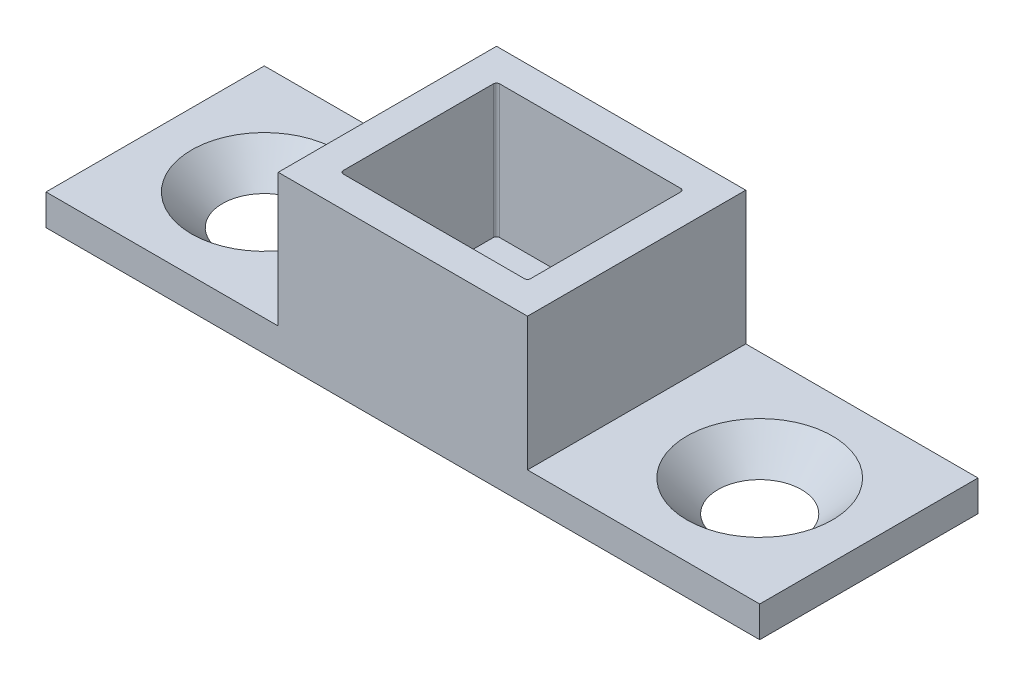
ISO-10303-21;
HEADER;
FILE_DESCRIPTION(('STEP AP214'),'2;1');
FILE_NAME('part.step','',(''),(''),'','','');
FILE_SCHEMA(('AUTOMOTIVE_DESIGN { 1 0 10303 214 1 1 1 1 }'));
ENDSEC;
DATA;
#1=APPLICATION_CONTEXT('core data for automotive mechanical design processes');
#2=APPLICATION_PROTOCOL_DEFINITION('international standard','automotive_design',2000,#1);
#3=PRODUCT_CONTEXT('',#1,'mechanical');
#4=PRODUCT('Part','Part','',(#3));
#5=PRODUCT_RELATED_PRODUCT_CATEGORY('part','',(#4));
#6=PRODUCT_DEFINITION_FORMATION('','',#4);
#7=PRODUCT_DEFINITION_CONTEXT('part definition',#1,'design');
#8=PRODUCT_DEFINITION('design','',#6,#7);
#9=PRODUCT_DEFINITION_SHAPE('','',#8);
#10=(LENGTH_UNIT() NAMED_UNIT(*) SI_UNIT(.MILLI.,.METRE.));
#11=(NAMED_UNIT(*) PLANE_ANGLE_UNIT() SI_UNIT($,.RADIAN.));
#12=(NAMED_UNIT(*) SI_UNIT($,.STERADIAN.) SOLID_ANGLE_UNIT());
#13=UNCERTAINTY_MEASURE_WITH_UNIT(LENGTH_MEASURE(1.E-05),#10,'distance_accuracy_value','');
#14=(GEOMETRIC_REPRESENTATION_CONTEXT(3) GLOBAL_UNCERTAINTY_ASSIGNED_CONTEXT((#13)) GLOBAL_UNIT_ASSIGNED_CONTEXT((#10,
#11,#12)) REPRESENTATION_CONTEXT('',''));
#15=CARTESIAN_POINT('',(0.,0.,0.));
#16=DIRECTION('',(0.,0.,1.));
#17=DIRECTION('',(1.,0.,0.));
#18=AXIS2_PLACEMENT_3D('',#15,#16,#17);
#19=CARTESIAN_POINT('',(-8.05,10.6,-7.05));
#20=DIRECTION('',(1.,0.,0.));
#21=DIRECTION('',(0.,0.,-1.));
#22=AXIS2_PLACEMENT_3D('',#19,#20,#21);
#23=PLANE('',#22);
#24=DIRECTION('',(0.,0.,-1.));
#25=VECTOR('',#24,1.);
#26=CARTESIAN_POINT('',(-8.05,2.,-7.05));
#27=LINE('',#26,#25);
#28=CARTESIAN_POINT('',(-8.05,2.,7.05));
#29=VERTEX_POINT('',#28);
#30=CARTESIAN_POINT('',(-8.05,2.,-7.05));
#31=VERTEX_POINT('',#30);
#32=EDGE_CURVE('E65',#29,#31,#27,.T.);
#33=ORIENTED_EDGE('',*,*,#32,.F.);
#34=DIRECTION('',(0.,-1.,0.));
#35=VECTOR('',#34,1.);
#36=CARTESIAN_POINT('',(-8.05,10.6,7.05));
#37=LINE('',#36,#35);
#38=CARTESIAN_POINT('',(-8.05,10.6,7.05));
#39=VERTEX_POINT('',#38);
#40=EDGE_CURVE('E176',#39,#29,#37,.T.);
#41=ORIENTED_EDGE('',*,*,#40,.F.);
#42=DIRECTION('',(0.,0.,1.));
#43=VECTOR('',#42,1.);
#44=CARTESIAN_POINT('',(-8.05,10.6,-7.05));
#45=LINE('',#44,#43);
#46=CARTESIAN_POINT('',(-8.05,10.6,-7.05));
#47=VERTEX_POINT('',#46);
#48=EDGE_CURVE('E257',#47,#39,#45,.T.);
#49=ORIENTED_EDGE('',*,*,#48,.F.);
#50=DIRECTION('',(0.,-1.,0.));
#51=VECTOR('',#50,1.);
#52=CARTESIAN_POINT('',(-8.05,10.6,-7.05));
#53=LINE('',#52,#51);
#54=EDGE_CURVE('E181',#47,#31,#53,.T.);
#55=ORIENTED_EDGE('',*,*,#54,.T.);
#56=EDGE_LOOP('',(#33,#41,#49,#55));
#57=FACE_BOUND('',#56,.T.);
#58=ADVANCED_FACE('F42',(#57),#23,.F.);
#59=CARTESIAN_POINT('',(0.,0.,0.));
#60=DIRECTION('',(0.,1.,0.));
#61=DIRECTION('',(0.,0.,1.));
#62=AXIS2_PLACEMENT_3D('',#59,#60,#61);
#63=PLANE('',#62);
#64=CARTESIAN_POINT('',(16.,0.,0.));
#65=DIRECTION('',(0.,1.,0.));
#66=DIRECTION('',(0.,0.,1.));
#67=AXIS2_PLACEMENT_3D('',#64,#65,#66);
#68=CIRCLE('',#67,2.7);
#69=CARTESIAN_POINT('',(16.,0.,2.7));
#70=VERTEX_POINT('',#69);
#71=EDGE_CURVE('E560',#70,#70,#68,.T.);
#72=ORIENTED_EDGE('',*,*,#71,.T.);
#73=EDGE_LOOP('',(#72));
#74=FACE_BOUND('',#73,.T.);
#75=CARTESIAN_POINT('',(-16.,0.,0.));
#76=DIRECTION('',(0.,1.,0.));
#77=DIRECTION('',(0.,0.,1.));
#78=AXIS2_PLACEMENT_3D('',#75,#76,#77);
#79=CIRCLE('',#78,2.7);
#80=CARTESIAN_POINT('',(-16.,0.,2.7));
#81=VERTEX_POINT('',#80);
#82=EDGE_CURVE('E286',#81,#81,#79,.T.);
#83=ORIENTED_EDGE('',*,*,#82,.T.);
#84=EDGE_LOOP('',(#83));
#85=FACE_BOUND('',#84,.T.);
#86=CARTESIAN_POINT('',(0.,0.,0.));
#87=DIRECTION('',(0.,1.,0.));
#88=DIRECTION('',(0.,0.,1.));
#89=AXIS2_PLACEMENT_3D('',#86,#87,#88);
#90=CIRCLE('',#89,2.25);
#91=CARTESIAN_POINT('',(0.,0.,2.25));
#92=VERTEX_POINT('',#91);
#93=EDGE_CURVE('E298',#92,#92,#90,.T.);
#94=ORIENTED_EDGE('',*,*,#93,.T.);
#95=EDGE_LOOP('',(#94));
#96=FACE_BOUND('',#95,.T.);
#97=CARTESIAN_POINT('',(4.5,0.,0.));
#98=DIRECTION('',(0.,-1.,0.));
#99=DIRECTION('',(0.,0.,-1.));
#100=AXIS2_PLACEMENT_3D('',#97,#98,#99);
#101=CIRCLE('',#100,2.);
#102=CARTESIAN_POINT('',(4.5,0.,-2.));
#103=VERTEX_POINT('',#102);
#104=EDGE_CURVE('E312',#103,#103,#101,.T.);
#105=ORIENTED_EDGE('',*,*,#104,.F.);
#106=EDGE_LOOP('',(#105));
#107=FACE_BOUND('',#106,.T.);
#108=DIRECTION('',(1.,0.,0.));
#109=VECTOR('',#108,1.);
#110=CARTESIAN_POINT('',(-8.05,0.,7.05));
#111=LINE('',#110,#109);
#112=CARTESIAN_POINT('',(-23.05,0.,7.05));
#113=VERTEX_POINT('',#112);
#114=CARTESIAN_POINT('',(23.05,0.,7.05));
#115=VERTEX_POINT('',#114);
#116=EDGE_CURVE('E247',#113,#115,#111,.T.);
#117=ORIENTED_EDGE('',*,*,#116,.F.);
#118=DIRECTION('',(0.,0.,1.));
#119=VECTOR('',#118,1.);
#120=CARTESIAN_POINT('',(-23.05,0.,-7.05));
#121=LINE('',#120,#119);
#122=CARTESIAN_POINT('',(-23.05,0.,-7.05));
#123=VERTEX_POINT('',#122);
#124=EDGE_CURVE('E283',#123,#113,#121,.T.);
#125=ORIENTED_EDGE('',*,*,#124,.F.);
#126=DIRECTION('',(-1.,0.,0.));
#127=VECTOR('',#126,1.);
#128=CARTESIAN_POINT('',(-8.05,0.,-7.05));
#129=LINE('',#128,#127);
#130=CARTESIAN_POINT('',(23.05,0.,-7.05));
#131=VERTEX_POINT('',#130);
#132=EDGE_CURVE('E249',#131,#123,#129,.T.);
#133=ORIENTED_EDGE('',*,*,#132,.F.);
#134=DIRECTION('',(0.,0.,1.));
#135=VECTOR('',#134,1.);
#136=CARTESIAN_POINT('',(23.05,0.,-7.05));
#137=LINE('',#136,#135);
#138=EDGE_CURVE('E163',#131,#115,#137,.T.);
#139=ORIENTED_EDGE('',*,*,#138,.T.);
#140=EDGE_LOOP('',(#117,#125,#133,#139));
#141=FACE_BOUND('',#140,.T.);
#142=CARTESIAN_POINT('',(-4.5,0.,0.));
#143=DIRECTION('',(0.,-1.,0.));
#144=DIRECTION('',(0.,0.,-1.));
#145=AXIS2_PLACEMENT_3D('',#142,#143,#144);
#146=CIRCLE('',#145,2.);
#147=CARTESIAN_POINT('',(-4.5,0.,-2.));
#148=VERTEX_POINT('',#147);
#149=EDGE_CURVE('E301',#148,#148,#146,.T.);
#150=ORIENTED_EDGE('',*,*,#149,.F.);
#151=EDGE_LOOP('',(#150));
#152=FACE_BOUND('',#151,.T.);
#153=ADVANCED_FACE('F355',(#74,#85,#96,#107,#141,#152),#63,.F.);
#154=CARTESIAN_POINT('',(-8.05,10.6,7.05));
#155=DIRECTION('',(0.,0.,-1.));
#156=DIRECTION('',(-1.,0.,0.));
#157=AXIS2_PLACEMENT_3D('',#154,#155,#156);
#158=PLANE('',#157);
#159=ORIENTED_EDGE('',*,*,#116,.T.);
#160=DIRECTION('',(0.,-1.,0.));
#161=VECTOR('',#160,1.);
#162=CARTESIAN_POINT('',(23.05,2.,7.05));
#163=LINE('',#162,#161);
#164=CARTESIAN_POINT('',(23.05,2.,7.05));
#165=VERTEX_POINT('',#164);
#166=EDGE_CURVE('E171',#165,#115,#163,.T.);
#167=ORIENTED_EDGE('',*,*,#166,.F.);
#168=DIRECTION('',(-1.,0.,0.));
#169=VECTOR('',#168,1.);
#170=CARTESIAN_POINT('',(8.05,2.,7.05));
#171=LINE('',#170,#169);
#172=CARTESIAN_POINT('',(8.05,2.,7.05));
#173=VERTEX_POINT('',#172);
#174=EDGE_CURVE('E157',#165,#173,#171,.T.);
#175=ORIENTED_EDGE('',*,*,#174,.T.);
#176=DIRECTION('',(0.,-1.,0.));
#177=VECTOR('',#176,1.);
#178=CARTESIAN_POINT('',(8.05,10.6,7.05));
#179=LINE('',#178,#177);
#180=CARTESIAN_POINT('',(8.05,10.6,7.05));
#181=VERTEX_POINT('',#180);
#182=EDGE_CURVE('E168',#181,#173,#179,.T.);
#183=ORIENTED_EDGE('',*,*,#182,.F.);
#184=DIRECTION('',(1.,0.,0.));
#185=VECTOR('',#184,1.);
#186=CARTESIAN_POINT('',(-8.05,10.6,7.05));
#187=LINE('',#186,#185);
#188=EDGE_CURVE('E260',#39,#181,#187,.T.);
#189=ORIENTED_EDGE('',*,*,#188,.F.);
#190=ORIENTED_EDGE('',*,*,#40,.T.);
#191=DIRECTION('',(1.,0.,0.));
#192=VECTOR('',#191,1.);
#193=CARTESIAN_POINT('',(-8.05,2.,7.05));
#194=LINE('',#193,#192);
#195=CARTESIAN_POINT('',(-23.05,2.,7.05));
#196=VERTEX_POINT('',#195);
#197=EDGE_CURVE('E282',#196,#29,#194,.T.);
#198=ORIENTED_EDGE('',*,*,#197,.F.);
#199=DIRECTION('',(0.,-1.,0.));
#200=VECTOR('',#199,1.);
#201=CARTESIAN_POINT('',(-23.05,2.,7.05));
#202=LINE('',#201,#200);
#203=EDGE_CURVE('E292',#196,#113,#202,.T.);
#204=ORIENTED_EDGE('',*,*,#203,.T.);
#205=EDGE_LOOP('',(#159,#167,#175,#183,#189,#190,#198,#204));
#206=FACE_BOUND('',#205,.T.);
#207=ADVANCED_FACE('F167',(#206),#158,.F.);
#208=CARTESIAN_POINT('',(8.05,10.6,-7.05));
#209=DIRECTION('',(-1.,0.,0.));
#210=DIRECTION('',(0.,0.,1.));
#211=AXIS2_PLACEMENT_3D('',#208,#209,#210);
#212=PLANE('',#211);
#213=ORIENTED_EDGE('',*,*,#182,.T.);
#214=DIRECTION('',(0.,0.,-1.));
#215=VECTOR('',#214,1.);
#216=CARTESIAN_POINT('',(8.05,2.,-7.05));
#217=LINE('',#216,#215);
#218=CARTESIAN_POINT('',(8.05,2.,-7.05));
#219=VERTEX_POINT('',#218);
#220=EDGE_CURVE('E154',#173,#219,#217,.T.);
#221=ORIENTED_EDGE('',*,*,#220,.T.);
#222=DIRECTION('',(0.,-1.,0.));
#223=VECTOR('',#222,1.);
#224=CARTESIAN_POINT('',(8.05,10.6,-7.05));
#225=LINE('',#224,#223);
#226=CARTESIAN_POINT('',(8.05,10.6,-7.05));
#227=VERTEX_POINT('',#226);
#228=EDGE_CURVE('E177',#227,#219,#225,.T.);
#229=ORIENTED_EDGE('',*,*,#228,.F.);
#230=DIRECTION('',(0.,0.,-1.));
#231=VECTOR('',#230,1.);
#232=CARTESIAN_POINT('',(8.05,10.6,-7.05));
#233=LINE('',#232,#231);
#234=EDGE_CURVE('E175',#181,#227,#233,.T.);
#235=ORIENTED_EDGE('',*,*,#234,.F.);
#236=EDGE_LOOP('',(#213,#221,#229,#235));
#237=FACE_BOUND('',#236,.T.);
#238=ADVANCED_FACE('F174',(#237),#212,.F.);
#239=CARTESIAN_POINT('',(-8.05,10.6,-7.05));
#240=DIRECTION('',(0.,0.,1.));
#241=DIRECTION('',(1.,0.,0.));
#242=AXIS2_PLACEMENT_3D('',#239,#240,#241);
#243=PLANE('',#242);
#244=ORIENTED_EDGE('',*,*,#132,.T.);
#245=DIRECTION('',(0.,-1.,0.));
#246=VECTOR('',#245,1.);
#247=CARTESIAN_POINT('',(-23.05,2.,-7.05));
#248=LINE('',#247,#246);
#249=CARTESIAN_POINT('',(-23.05,2.,-7.05));
#250=VERTEX_POINT('',#249);
#251=EDGE_CURVE('E274',#250,#123,#248,.T.);
#252=ORIENTED_EDGE('',*,*,#251,.F.);
#253=DIRECTION('',(-1.,0.,0.));
#254=VECTOR('',#253,1.);
#255=CARTESIAN_POINT('',(-8.05,2.,-7.05));
#256=LINE('',#255,#254);
#257=EDGE_CURVE('E271',#31,#250,#256,.T.);
#258=ORIENTED_EDGE('',*,*,#257,.F.);
#259=ORIENTED_EDGE('',*,*,#54,.F.);
#260=DIRECTION('',(-1.,0.,0.));
#261=VECTOR('',#260,1.);
#262=CARTESIAN_POINT('',(-8.05,10.6,-7.05));
#263=LINE('',#262,#261);
#264=EDGE_CURVE('E263',#227,#47,#263,.T.);
#265=ORIENTED_EDGE('',*,*,#264,.F.);
#266=ORIENTED_EDGE('',*,*,#228,.T.);
#267=DIRECTION('',(1.,0.,0.));
#268=VECTOR('',#267,1.);
#269=CARTESIAN_POINT('',(8.05,2.,-7.05));
#270=LINE('',#269,#268);
#271=CARTESIAN_POINT('',(23.05,2.,-7.05));
#272=VERTEX_POINT('',#271);
#273=EDGE_CURVE('E57',#219,#272,#270,.T.);
#274=ORIENTED_EDGE('',*,*,#273,.T.);
#275=DIRECTION('',(0.,-1.,0.));
#276=VECTOR('',#275,1.);
#277=CARTESIAN_POINT('',(23.05,2.,-7.05));
#278=LINE('',#277,#276);
#279=EDGE_CURVE('E569',#272,#131,#278,.T.);
#280=ORIENTED_EDGE('',*,*,#279,.T.);
#281=EDGE_LOOP('',(#244,#252,#258,#259,#265,#266,#274,#280));
#282=FACE_BOUND('',#281,.T.);
#283=ADVANCED_FACE('F272',(#282),#243,.F.);
#284=CARTESIAN_POINT('',(0.,10.6,0.));
#285=DIRECTION('',(0.,1.,0.));
#286=DIRECTION('',(0.,0.,1.));
#287=AXIS2_PLACEMENT_3D('',#284,#285,#286);
#288=PLANE('',#287);
#289=DIRECTION('',(0.,0.,1.));
#290=VECTOR('',#289,1.);
#291=CARTESIAN_POINT('',(-6.05,10.6,-5.05));
#292=LINE('',#291,#290);
#293=CARTESIAN_POINT('',(-6.05,10.6,-4.85));
#294=VERTEX_POINT('',#293);
#295=CARTESIAN_POINT('',(-6.05,10.6,4.85));
#296=VERTEX_POINT('',#295);
#297=EDGE_CURVE('E221',#294,#296,#292,.T.);
#298=ORIENTED_EDGE('',*,*,#297,.F.);
#299=CARTESIAN_POINT('',(-5.85,10.6,-4.85));
#300=DIRECTION('',(0.,1.,0.));
#301=DIRECTION('',(0.,0.,1.));
#302=AXIS2_PLACEMENT_3D('',#299,#300,#301);
#303=CIRCLE('',#302,0.2);
#304=CARTESIAN_POINT('',(-5.85,10.6,-5.05));
#305=VERTEX_POINT('',#304);
#306=EDGE_CURVE('E212',#294,#305,#303,.F.);
#307=ORIENTED_EDGE('',*,*,#306,.T.);
#308=DIRECTION('',(-1.,0.,0.));
#309=VECTOR('',#308,1.);
#310=CARTESIAN_POINT('',(-6.05,10.6,-5.05));
#311=LINE('',#310,#309);
#312=CARTESIAN_POINT('',(5.85,10.6,-5.05));
#313=VERTEX_POINT('',#312);
#314=EDGE_CURVE('E255',#313,#305,#311,.T.);
#315=ORIENTED_EDGE('',*,*,#314,.F.);
#316=CARTESIAN_POINT('',(5.85,10.6,-4.85));
#317=DIRECTION('',(0.,1.,0.));
#318=DIRECTION('',(0.,0.,1.));
#319=AXIS2_PLACEMENT_3D('',#316,#317,#318);
#320=CIRCLE('',#319,0.2);
#321=CARTESIAN_POINT('',(6.05,10.6,-4.85));
#322=VERTEX_POINT('',#321);
#323=EDGE_CURVE('E214',#313,#322,#320,.F.);
#324=ORIENTED_EDGE('',*,*,#323,.T.);
#325=DIRECTION('',(0.,0.,-1.));
#326=VECTOR('',#325,1.);
#327=CARTESIAN_POINT('',(6.05,10.6,-5.05));
#328=LINE('',#327,#326);
#329=CARTESIAN_POINT('',(6.05,10.6,4.85));
#330=VERTEX_POINT('',#329);
#331=EDGE_CURVE('E325',#330,#322,#328,.T.);
#332=ORIENTED_EDGE('',*,*,#331,.F.);
#333=CARTESIAN_POINT('',(5.85,10.6,4.85));
#334=DIRECTION('',(0.,1.,0.));
#335=DIRECTION('',(0.,0.,1.));
#336=AXIS2_PLACEMENT_3D('',#333,#334,#335);
#337=CIRCLE('',#336,0.2);
#338=CARTESIAN_POINT('',(5.85,10.6,5.05));
#339=VERTEX_POINT('',#338);
#340=EDGE_CURVE('E12',#330,#339,#337,.F.);
#341=ORIENTED_EDGE('',*,*,#340,.T.);
#342=DIRECTION('',(1.,0.,0.));
#343=VECTOR('',#342,1.);
#344=CARTESIAN_POINT('',(-6.05,10.6,5.05));
#345=LINE('',#344,#343);
#346=CARTESIAN_POINT('',(-5.85,10.6,5.05));
#347=VERTEX_POINT('',#346);
#348=EDGE_CURVE('E223',#347,#339,#345,.T.);
#349=ORIENTED_EDGE('',*,*,#348,.F.);
#350=CARTESIAN_POINT('',(-5.85,10.6,4.85));
#351=DIRECTION('',(0.,1.,0.));
#352=DIRECTION('',(0.,0.,1.));
#353=AXIS2_PLACEMENT_3D('',#350,#351,#352);
#354=CIRCLE('',#353,0.2);
#355=EDGE_CURVE('E50',#347,#296,#354,.F.);
#356=ORIENTED_EDGE('',*,*,#355,.T.);
#357=EDGE_LOOP('',(#298,#307,#315,#324,#332,#341,#349,#356));
#358=FACE_BOUND('',#357,.T.);
#359=ORIENTED_EDGE('',*,*,#48,.T.);
#360=ORIENTED_EDGE('',*,*,#188,.T.);
#361=ORIENTED_EDGE('',*,*,#234,.T.);
#362=ORIENTED_EDGE('',*,*,#264,.T.);
#363=EDGE_LOOP('',(#359,#360,#361,#362));
#364=FACE_BOUND('',#363,.T.);
#365=ADVANCED_FACE('F219',(#358,#364),#288,.T.);
#366=CARTESIAN_POINT('',(-6.05,-15.7613451202618,-5.05));
#367=DIRECTION('',(-1.,0.,0.));
#368=DIRECTION('',(0.,0.,1.));
#369=AXIS2_PLACEMENT_3D('',#366,#367,#368);
#370=PLANE('',#369);
#371=DIRECTION('',(0.,0.,-1.));
#372=VECTOR('',#371,1.);
#373=CARTESIAN_POINT('',(-6.05,2.,-5.05));
#374=LINE('',#373,#372);
#375=CARTESIAN_POINT('',(-6.05,2.,4.85));
#376=VERTEX_POINT('',#375);
#377=CARTESIAN_POINT('',(-6.05,2.,-4.85));
#378=VERTEX_POINT('',#377);
#379=EDGE_CURVE('E243',#376,#378,#374,.T.);
#380=ORIENTED_EDGE('',*,*,#379,.T.);
#381=DIRECTION('',(0.,1.,0.));
#382=VECTOR('',#381,1.);
#383=CARTESIAN_POINT('',(-6.05,10.6,-4.85));
#384=LINE('',#383,#382);
#385=EDGE_CURVE('E186',#378,#294,#384,.T.);
#386=ORIENTED_EDGE('',*,*,#385,.T.);
#387=ORIENTED_EDGE('',*,*,#297,.T.);
#388=DIRECTION('',(0.,1.,0.));
#389=VECTOR('',#388,1.);
#390=CARTESIAN_POINT('',(-6.05,2.,4.85));
#391=LINE('',#390,#389);
#392=EDGE_CURVE('E179',#296,#376,#391,.F.);
#393=ORIENTED_EDGE('',*,*,#392,.T.);
#394=EDGE_LOOP('',(#380,#386,#387,#393));
#395=FACE_BOUND('',#394,.T.);
#396=ADVANCED_FACE('F229',(#395),#370,.F.);
#397=CARTESIAN_POINT('',(-6.05,-15.7613451202618,-5.05));
#398=DIRECTION('',(0.,0.,-1.));
#399=DIRECTION('',(-1.,0.,0.));
#400=AXIS2_PLACEMENT_3D('',#397,#398,#399);
#401=PLANE('',#400);
#402=ORIENTED_EDGE('',*,*,#314,.T.);
#403=DIRECTION('',(0.,1.,0.));
#404=VECTOR('',#403,1.);
#405=CARTESIAN_POINT('',(-5.85,2.,-5.05));
#406=LINE('',#405,#404);
#407=CARTESIAN_POINT('',(-5.85,2.,-5.05));
#408=VERTEX_POINT('',#407);
#409=EDGE_CURVE('E192',#305,#408,#406,.F.);
#410=ORIENTED_EDGE('',*,*,#409,.T.);
#411=DIRECTION('',(1.,0.,0.));
#412=VECTOR('',#411,1.);
#413=CARTESIAN_POINT('',(-6.05,2.,-5.05));
#414=LINE('',#413,#412);
#415=CARTESIAN_POINT('',(5.85,2.,-5.05));
#416=VERTEX_POINT('',#415);
#417=EDGE_CURVE('E251',#408,#416,#414,.T.);
#418=ORIENTED_EDGE('',*,*,#417,.T.);
#419=DIRECTION('',(0.,1.,0.));
#420=VECTOR('',#419,1.);
#421=CARTESIAN_POINT('',(5.85,10.6,-5.05));
#422=LINE('',#421,#420);
#423=EDGE_CURVE('E189',#416,#313,#422,.T.);
#424=ORIENTED_EDGE('',*,*,#423,.T.);
#425=EDGE_LOOP('',(#402,#410,#418,#424));
#426=FACE_BOUND('',#425,.T.);
#427=ADVANCED_FACE('F334',(#426),#401,.F.);
#428=CARTESIAN_POINT('',(6.05,-15.7613451202618,-5.05));
#429=DIRECTION('',(1.,0.,0.));
#430=DIRECTION('',(0.,0.,-1.));
#431=AXIS2_PLACEMENT_3D('',#428,#429,#430);
#432=PLANE('',#431);
#433=ORIENTED_EDGE('',*,*,#331,.T.);
#434=DIRECTION('',(0.,1.,0.));
#435=VECTOR('',#434,1.);
#436=CARTESIAN_POINT('',(6.05,2.,-4.85));
#437=LINE('',#436,#435);
#438=CARTESIAN_POINT('',(6.05,2.,-4.85));
#439=VERTEX_POINT('',#438);
#440=EDGE_CURVE('E205',#322,#439,#437,.F.);
#441=ORIENTED_EDGE('',*,*,#440,.T.);
#442=DIRECTION('',(0.,0.,1.));
#443=VECTOR('',#442,1.);
#444=CARTESIAN_POINT('',(6.05,2.,-5.05));
#445=LINE('',#444,#443);
#446=CARTESIAN_POINT('',(6.05,2.,4.85));
#447=VERTEX_POINT('',#446);
#448=EDGE_CURVE('E320',#439,#447,#445,.T.);
#449=ORIENTED_EDGE('',*,*,#448,.T.);
#450=DIRECTION('',(0.,1.,0.));
#451=VECTOR('',#450,1.);
#452=CARTESIAN_POINT('',(6.05,10.6,4.85));
#453=LINE('',#452,#451);
#454=EDGE_CURVE('E202',#447,#330,#453,.T.);
#455=ORIENTED_EDGE('',*,*,#454,.T.);
#456=EDGE_LOOP('',(#433,#441,#449,#455));
#457=FACE_BOUND('',#456,.T.);
#458=ADVANCED_FACE('F345',(#457),#432,.F.);
#459=CARTESIAN_POINT('',(-6.05,-15.7613451202618,5.05));
#460=DIRECTION('',(0.,0.,1.));
#461=DIRECTION('',(1.,0.,0.));
#462=AXIS2_PLACEMENT_3D('',#459,#460,#461);
#463=PLANE('',#462);
#464=DIRECTION('',(-1.,0.,0.));
#465=VECTOR('',#464,1.);
#466=CARTESIAN_POINT('',(-6.05,2.,5.05));
#467=LINE('',#466,#465);
#468=CARTESIAN_POINT('',(5.85,2.,5.05));
#469=VERTEX_POINT('',#468);
#470=CARTESIAN_POINT('',(-5.85,2.,5.05));
#471=VERTEX_POINT('',#470);
#472=EDGE_CURVE('E241',#469,#471,#467,.T.);
#473=ORIENTED_EDGE('',*,*,#472,.T.);
#474=DIRECTION('',(0.,1.,0.));
#475=VECTOR('',#474,1.);
#476=CARTESIAN_POINT('',(-5.85,10.6,5.05));
#477=LINE('',#476,#475);
#478=EDGE_CURVE('E209',#471,#347,#477,.T.);
#479=ORIENTED_EDGE('',*,*,#478,.T.);
#480=ORIENTED_EDGE('',*,*,#348,.T.);
#481=DIRECTION('',(0.,1.,0.));
#482=VECTOR('',#481,1.);
#483=CARTESIAN_POINT('',(5.85,1.99999999999999,5.05));
#484=LINE('',#483,#482);
#485=EDGE_CURVE('E207',#339,#469,#484,.F.);
#486=ORIENTED_EDGE('',*,*,#485,.T.);
#487=EDGE_LOOP('',(#473,#479,#480,#486));
#488=FACE_BOUND('',#487,.T.);
#489=ADVANCED_FACE('F245',(#488),#463,.F.);
#490=CARTESIAN_POINT('',(0.,2.,0.));
#491=DIRECTION('',(0.,1.,0.));
#492=DIRECTION('',(0.,0.,1.));
#493=AXIS2_PLACEMENT_3D('',#490,#491,#492);
#494=PLANE('',#493);
#495=CARTESIAN_POINT('',(0.,2.,0.));
#496=DIRECTION('',(0.,1.,0.));
#497=DIRECTION('',(0.,0.,1.));
#498=AXIS2_PLACEMENT_3D('',#495,#496,#497);
#499=CIRCLE('',#498,2.25);
#500=CARTESIAN_POINT('',(0.,2.,2.25));
#501=VERTEX_POINT('',#500);
#502=EDGE_CURVE('E297',#501,#501,#499,.T.);
#503=ORIENTED_EDGE('',*,*,#502,.F.);
#504=EDGE_LOOP('',(#503));
#505=FACE_BOUND('',#504,.T.);
#506=CARTESIAN_POINT('',(-4.5,2.,0.));
#507=DIRECTION('',(0.,1.,0.));
#508=DIRECTION('',(0.,0.,1.));
#509=AXIS2_PLACEMENT_3D('',#506,#507,#508);
#510=CIRCLE('',#509,0.999999999999999);
#511=CARTESIAN_POINT('',(-4.5,2.,0.999999999999999));
#512=VERTEX_POINT('',#511);
#513=EDGE_CURVE('E309',#512,#512,#510,.T.);
#514=ORIENTED_EDGE('',*,*,#513,.F.);
#515=EDGE_LOOP('',(#514));
#516=FACE_BOUND('',#515,.T.);
#517=CARTESIAN_POINT('',(4.5,2.,0.));
#518=DIRECTION('',(0.,1.,0.));
#519=DIRECTION('',(0.,0.,1.));
#520=AXIS2_PLACEMENT_3D('',#517,#518,#519);
#521=CIRCLE('',#520,1.);
#522=CARTESIAN_POINT('',(4.5,2.,1.));
#523=VERTEX_POINT('',#522);
#524=EDGE_CURVE('E232',#523,#523,#521,.T.);
#525=ORIENTED_EDGE('',*,*,#524,.F.);
#526=EDGE_LOOP('',(#525));
#527=FACE_BOUND('',#526,.T.);
#528=ORIENTED_EDGE('',*,*,#417,.F.);
#529=CARTESIAN_POINT('',(-5.85,2.,-4.85));
#530=DIRECTION('',(0.,1.,0.));
#531=DIRECTION('',(0.,0.,1.));
#532=AXIS2_PLACEMENT_3D('',#529,#530,#531);
#533=CIRCLE('',#532,0.2);
#534=EDGE_CURVE('E200',#408,#378,#533,.T.);
#535=ORIENTED_EDGE('',*,*,#534,.T.);
#536=ORIENTED_EDGE('',*,*,#379,.F.);
#537=CARTESIAN_POINT('',(-5.85,2.,4.85));
#538=DIRECTION('',(0.,1.,0.));
#539=DIRECTION('',(0.,0.,1.));
#540=AXIS2_PLACEMENT_3D('',#537,#538,#539);
#541=CIRCLE('',#540,0.2);
#542=EDGE_CURVE('E196',#376,#471,#541,.T.);
#543=ORIENTED_EDGE('',*,*,#542,.T.);
#544=ORIENTED_EDGE('',*,*,#472,.F.);
#545=CARTESIAN_POINT('',(5.85,2.,4.85));
#546=DIRECTION('',(0.,1.,0.));
#547=DIRECTION('',(0.,0.,1.));
#548=AXIS2_PLACEMENT_3D('',#545,#546,#547);
#549=CIRCLE('',#548,0.2);
#550=EDGE_CURVE('E194',#469,#447,#549,.T.);
#551=ORIENTED_EDGE('',*,*,#550,.T.);
#552=ORIENTED_EDGE('',*,*,#448,.F.);
#553=CARTESIAN_POINT('',(5.85,2.,-4.85));
#554=DIRECTION('',(0.,1.,0.));
#555=DIRECTION('',(0.,0.,1.));
#556=AXIS2_PLACEMENT_3D('',#553,#554,#555);
#557=CIRCLE('',#556,0.2);
#558=EDGE_CURVE('E198',#439,#416,#557,.T.);
#559=ORIENTED_EDGE('',*,*,#558,.T.);
#560=EDGE_LOOP('',(#528,#535,#536,#543,#544,#551,#552,#559));
#561=FACE_BOUND('',#560,.T.);
#562=ADVANCED_FACE('F240',(#505,#516,#527,#561),#494,.T.);
#563=CARTESIAN_POINT('',(4.5,0.,0.));
#564=DIRECTION('',(0.,-1.,0.));
#565=DIRECTION('',(0.,0.,-1.));
#566=AXIS2_PLACEMENT_3D('',#563,#564,#565);
#567=CYLINDRICAL_SURFACE('',#566,1.);
#568=CARTESIAN_POINT('',(4.5,1.,0.));
#569=DIRECTION('',(0.,-1.,0.));
#570=DIRECTION('',(0.,0.,-1.));
#571=AXIS2_PLACEMENT_3D('',#568,#569,#570);
#572=CIRCLE('',#571,0.999999999999999);
#573=CARTESIAN_POINT('',(4.5,1.,-0.999999999999999));
#574=VERTEX_POINT('',#573);
#575=EDGE_CURVE('E315',#574,#574,#572,.T.);
#576=ORIENTED_EDGE('',*,*,#575,.T.);
#577=EDGE_LOOP('',(#576));
#578=FACE_BOUND('',#577,.T.);
#579=ORIENTED_EDGE('',*,*,#524,.T.);
#580=EDGE_LOOP('',(#579));
#581=FACE_BOUND('',#580,.T.);
#582=ADVANCED_FACE('F403',(#578,#581),#567,.F.);
#583=CARTESIAN_POINT('',(4.5,0.,0.));
#584=DIRECTION('',(0.,-1.,0.));
#585=DIRECTION('',(0.,0.,-1.));
#586=AXIS2_PLACEMENT_3D('',#583,#584,#585);
#587=CONICAL_SURFACE('',#586,2.,0.785398163397449);
#588=ORIENTED_EDGE('',*,*,#575,.F.);
#589=EDGE_LOOP('',(#588));
#590=FACE_BOUND('',#589,.T.);
#591=ORIENTED_EDGE('',*,*,#104,.T.);
#592=EDGE_LOOP('',(#591));
#593=FACE_BOUND('',#592,.T.);
#594=ADVANCED_FACE('F399',(#590,#593),#587,.F.);
#595=CARTESIAN_POINT('',(-4.5,0.,0.));
#596=DIRECTION('',(0.,-1.,0.));
#597=DIRECTION('',(0.,0.,-1.));
#598=AXIS2_PLACEMENT_3D('',#595,#596,#597);
#599=CYLINDRICAL_SURFACE('',#598,0.999999999999999);
#600=CARTESIAN_POINT('',(-4.5,1.,0.));
#601=DIRECTION('',(0.,-1.,0.));
#602=DIRECTION('',(0.,0.,-1.));
#603=AXIS2_PLACEMENT_3D('',#600,#601,#602);
#604=CIRCLE('',#603,0.999999999999999);
#605=CARTESIAN_POINT('',(-4.5,1.,-0.999999999999999));
#606=VERTEX_POINT('',#605);
#607=EDGE_CURVE('E306',#606,#606,#604,.T.);
#608=ORIENTED_EDGE('',*,*,#607,.T.);
#609=EDGE_LOOP('',(#608));
#610=FACE_BOUND('',#609,.T.);
#611=ORIENTED_EDGE('',*,*,#513,.T.);
#612=EDGE_LOOP('',(#611));
#613=FACE_BOUND('',#612,.T.);
#614=ADVANCED_FACE('F395',(#610,#613),#599,.F.);
#615=CARTESIAN_POINT('',(-4.5,0.,0.));
#616=DIRECTION('',(0.,-1.,0.));
#617=DIRECTION('',(0.,0.,-1.));
#618=AXIS2_PLACEMENT_3D('',#615,#616,#617);
#619=CONICAL_SURFACE('',#618,2.,0.785398163397449);
#620=ORIENTED_EDGE('',*,*,#607,.F.);
#621=EDGE_LOOP('',(#620));
#622=FACE_BOUND('',#621,.T.);
#623=ORIENTED_EDGE('',*,*,#149,.T.);
#624=EDGE_LOOP('',(#623));
#625=FACE_BOUND('',#624,.T.);
#626=ADVANCED_FACE('F391',(#622,#625),#619,.F.);
#627=CARTESIAN_POINT('',(0.,0.,0.));
#628=DIRECTION('',(0.,1.,0.));
#629=DIRECTION('',(0.,0.,1.));
#630=AXIS2_PLACEMENT_3D('',#627,#628,#629);
#631=CYLINDRICAL_SURFACE('',#630,2.25);
#632=ORIENTED_EDGE('',*,*,#93,.F.);
#633=EDGE_LOOP('',(#632));
#634=FACE_BOUND('',#633,.T.);
#635=ORIENTED_EDGE('',*,*,#502,.T.);
#636=EDGE_LOOP('',(#635));
#637=FACE_BOUND('',#636,.T.);
#638=ADVANCED_FACE('F369',(#634,#637),#631,.F.);
#639=CARTESIAN_POINT('',(-5.85,-15.7613451202618,-4.85));
#640=DIRECTION('',(0.,-1.,0.));
#641=DIRECTION('',(0.,0.,-1.));
#642=AXIS2_PLACEMENT_3D('',#639,#640,#641);
#643=CYLINDRICAL_SURFACE('',#642,0.2);
#644=ORIENTED_EDGE('',*,*,#534,.F.);
#645=ORIENTED_EDGE('',*,*,#409,.F.);
#646=ORIENTED_EDGE('',*,*,#306,.F.);
#647=ORIENTED_EDGE('',*,*,#385,.F.);
#648=EDGE_LOOP('',(#644,#645,#646,#647));
#649=FACE_BOUND('',#648,.T.);
#650=ADVANCED_FACE('F338',(#649),#643,.F.);
#651=CARTESIAN_POINT('',(5.85,-15.7613451202618,-4.85));
#652=DIRECTION('',(0.,-1.,0.));
#653=DIRECTION('',(0.,0.,-1.));
#654=AXIS2_PLACEMENT_3D('',#651,#652,#653);
#655=CYLINDRICAL_SURFACE('',#654,0.2);
#656=ORIENTED_EDGE('',*,*,#558,.F.);
#657=ORIENTED_EDGE('',*,*,#440,.F.);
#658=ORIENTED_EDGE('',*,*,#323,.F.);
#659=ORIENTED_EDGE('',*,*,#423,.F.);
#660=EDGE_LOOP('',(#656,#657,#658,#659));
#661=FACE_BOUND('',#660,.T.);
#662=ADVANCED_FACE('F342',(#661),#655,.F.);
#663=CARTESIAN_POINT('',(-5.85,-15.7613451202618,4.85));
#664=DIRECTION('',(0.,-1.,0.));
#665=DIRECTION('',(0.,0.,-1.));
#666=AXIS2_PLACEMENT_3D('',#663,#664,#665);
#667=CYLINDRICAL_SURFACE('',#666,0.2);
#668=ORIENTED_EDGE('',*,*,#542,.F.);
#669=ORIENTED_EDGE('',*,*,#392,.F.);
#670=ORIENTED_EDGE('',*,*,#355,.F.);
#671=ORIENTED_EDGE('',*,*,#478,.F.);
#672=EDGE_LOOP('',(#668,#669,#670,#671));
#673=FACE_BOUND('',#672,.T.);
#674=ADVANCED_FACE('F235',(#673),#667,.F.);
#675=CARTESIAN_POINT('',(5.85,-15.7613451202618,4.85));
#676=DIRECTION('',(0.,-1.,0.));
#677=DIRECTION('',(0.,0.,-1.));
#678=AXIS2_PLACEMENT_3D('',#675,#676,#677);
#679=CYLINDRICAL_SURFACE('',#678,0.2);
#680=ORIENTED_EDGE('',*,*,#550,.F.);
#681=ORIENTED_EDGE('',*,*,#485,.F.);
#682=ORIENTED_EDGE('',*,*,#340,.F.);
#683=ORIENTED_EDGE('',*,*,#454,.F.);
#684=EDGE_LOOP('',(#680,#681,#682,#683));
#685=FACE_BOUND('',#684,.T.);
#686=ADVANCED_FACE('F44',(#685),#679,.F.);
#687=CARTESIAN_POINT('',(-23.05,2.,-7.05));
#688=DIRECTION('',(1.,0.,0.));
#689=DIRECTION('',(0.,0.,-1.));
#690=AXIS2_PLACEMENT_3D('',#687,#688,#689);
#691=PLANE('',#690);
#692=ORIENTED_EDGE('',*,*,#124,.T.);
#693=ORIENTED_EDGE('',*,*,#203,.F.);
#694=DIRECTION('',(0.,0.,1.));
#695=VECTOR('',#694,1.);
#696=CARTESIAN_POINT('',(-23.05,2.,-7.05));
#697=LINE('',#696,#695);
#698=EDGE_CURVE('E277',#250,#196,#697,.T.);
#699=ORIENTED_EDGE('',*,*,#698,.F.);
#700=ORIENTED_EDGE('',*,*,#251,.T.);
#701=EDGE_LOOP('',(#692,#693,#699,#700));
#702=FACE_BOUND('',#701,.T.);
#703=ADVANCED_FACE('F375',(#702),#691,.F.);
#704=CARTESIAN_POINT('',(0.,2.,0.));
#705=DIRECTION('',(0.,-1.,0.));
#706=DIRECTION('',(0.,0.,-1.));
#707=AXIS2_PLACEMENT_3D('',#704,#705,#706);
#708=PLANE('',#707);
#709=CARTESIAN_POINT('',(-16.,2.,0.));
#710=DIRECTION('',(0.,1.,0.));
#711=DIRECTION('',(0.,0.,1.));
#712=AXIS2_PLACEMENT_3D('',#709,#710,#711);
#713=CIRCLE('',#712,4.7);
#714=CARTESIAN_POINT('',(-16.,2.,4.7));
#715=VERTEX_POINT('',#714);
#716=EDGE_CURVE('E574',#715,#715,#713,.T.);
#717=ORIENTED_EDGE('',*,*,#716,.F.);
#718=EDGE_LOOP('',(#717));
#719=FACE_BOUND('',#718,.T.);
#720=ORIENTED_EDGE('',*,*,#32,.T.);
#721=ORIENTED_EDGE('',*,*,#257,.T.);
#722=ORIENTED_EDGE('',*,*,#698,.T.);
#723=ORIENTED_EDGE('',*,*,#197,.T.);
#724=EDGE_LOOP('',(#720,#721,#722,#723));
#725=FACE_BOUND('',#724,.T.);
#726=ADVANCED_FACE('F280',(#719,#725),#708,.F.);
#727=CARTESIAN_POINT('',(-16.,2.,0.));
#728=DIRECTION('',(0.,1.,0.));
#729=DIRECTION('',(0.,0.,1.));
#730=AXIS2_PLACEMENT_3D('',#727,#728,#729);
#731=CONICAL_SURFACE('',#730,4.7,0.785398163397448);
#732=ORIENTED_EDGE('',*,*,#82,.F.);
#733=EDGE_LOOP('',(#732));
#734=FACE_BOUND('',#733,.T.);
#735=ORIENTED_EDGE('',*,*,#716,.T.);
#736=EDGE_LOOP('',(#735));
#737=FACE_BOUND('',#736,.T.);
#738=ADVANCED_FACE('F384',(#734,#737),#731,.F.);
#739=CARTESIAN_POINT('',(23.05,2.,-7.05));
#740=DIRECTION('',(1.,0.,0.));
#741=DIRECTION('',(0.,0.,-1.));
#742=AXIS2_PLACEMENT_3D('',#739,#740,#741);
#743=PLANE('',#742);
#744=ORIENTED_EDGE('',*,*,#138,.F.);
#745=ORIENTED_EDGE('',*,*,#279,.F.);
#746=DIRECTION('',(0.,0.,1.));
#747=VECTOR('',#746,1.);
#748=CARTESIAN_POINT('',(23.05,2.,-7.05));
#749=LINE('',#748,#747);
#750=EDGE_CURVE('E172',#272,#165,#749,.T.);
#751=ORIENTED_EDGE('',*,*,#750,.T.);
#752=ORIENTED_EDGE('',*,*,#166,.T.);
#753=EDGE_LOOP('',(#744,#745,#751,#752));
#754=FACE_BOUND('',#753,.T.);
#755=ADVANCED_FACE('F515',(#754),#743,.T.);
#756=CARTESIAN_POINT('',(0.,2.,0.));
#757=DIRECTION('',(0.,-1.,0.));
#758=DIRECTION('',(0.,0.,-1.));
#759=AXIS2_PLACEMENT_3D('',#756,#757,#758);
#760=PLANE('',#759);
#761=CARTESIAN_POINT('',(16.,2.,0.));
#762=DIRECTION('',(0.,1.,0.));
#763=DIRECTION('',(0.,0.,1.));
#764=AXIS2_PLACEMENT_3D('',#761,#762,#763);
#765=CIRCLE('',#764,4.7);
#766=CARTESIAN_POINT('',(16.,2.,4.7));
#767=VERTEX_POINT('',#766);
#768=EDGE_CURVE('E563',#767,#767,#765,.T.);
#769=ORIENTED_EDGE('',*,*,#768,.F.);
#770=EDGE_LOOP('',(#769));
#771=FACE_BOUND('',#770,.T.);
#772=ORIENTED_EDGE('',*,*,#220,.F.);
#773=ORIENTED_EDGE('',*,*,#174,.F.);
#774=ORIENTED_EDGE('',*,*,#750,.F.);
#775=ORIENTED_EDGE('',*,*,#273,.F.);
#776=EDGE_LOOP('',(#772,#773,#774,#775));
#777=FACE_BOUND('',#776,.T.);
#778=ADVANCED_FACE('F156',(#771,#777),#760,.F.);
#779=CARTESIAN_POINT('',(16.,2.,0.));
#780=DIRECTION('',(0.,1.,0.));
#781=DIRECTION('',(0.,0.,1.));
#782=AXIS2_PLACEMENT_3D('',#779,#780,#781);
#783=CONICAL_SURFACE('',#782,4.7,0.785398163397448);
#784=ORIENTED_EDGE('',*,*,#71,.F.);
#785=EDGE_LOOP('',(#784));
#786=FACE_BOUND('',#785,.T.);
#787=ORIENTED_EDGE('',*,*,#768,.T.);
#788=EDGE_LOOP('',(#787));
#789=FACE_BOUND('',#788,.T.);
#790=ADVANCED_FACE('F543',(#786,#789),#783,.F.);
#791=CLOSED_SHELL('',(#58,#153,#207,#238,#283,#365,#396,#427,#458,#489,#562,#582,#594,#614,#626,
#638,#650,#662,#674,#686,#703,#726,#738,#755,#778,#790));
#792=MANIFOLD_SOLID_BREP('B2',#791);
#793=ADVANCED_BREP_SHAPE_REPRESENTATION('',(#18,#792),#14);
#794=SHAPE_DEFINITION_REPRESENTATION(#9,#793);
ENDSEC;
END-ISO-10303-21;
